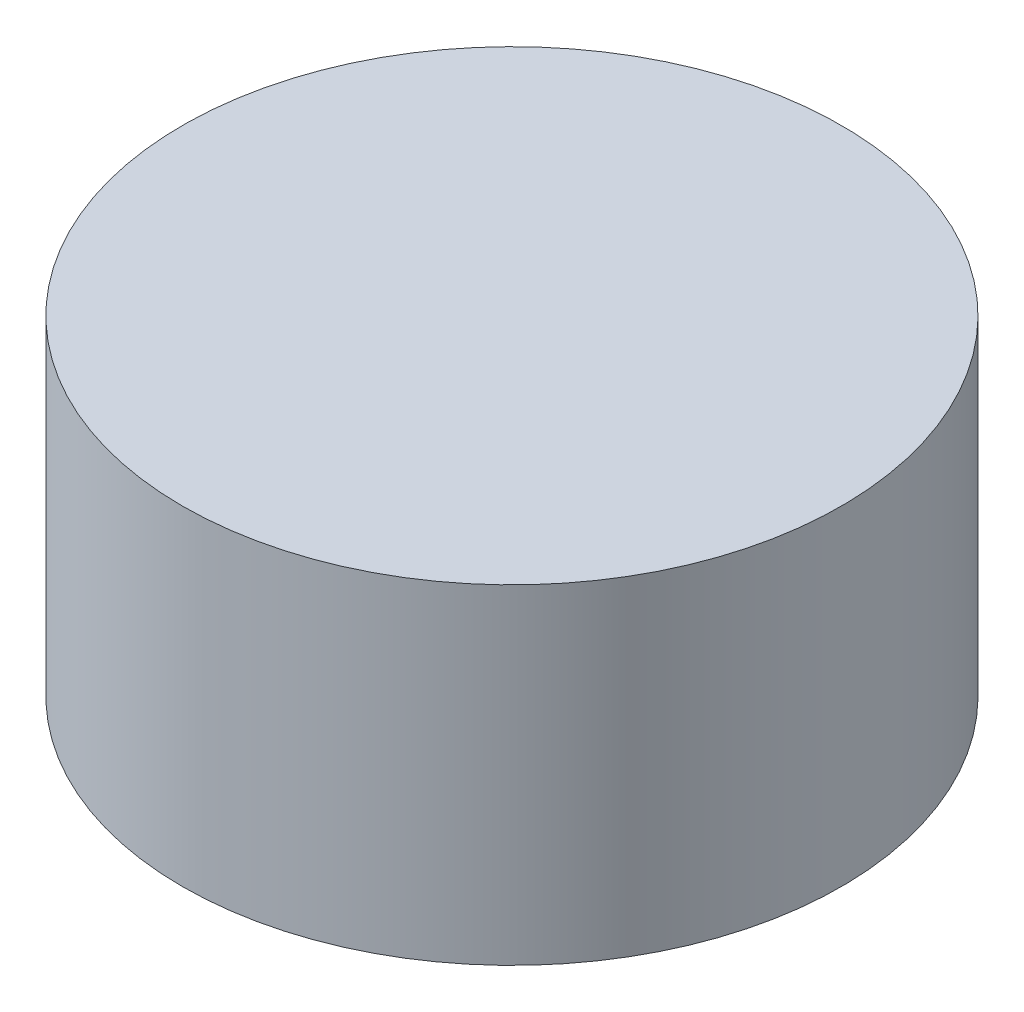
ISO-10303-21;
HEADER;
FILE_DESCRIPTION(('STEP AP214'),'2;1');
FILE_NAME('part.step','',(''),(''),'','','');
FILE_SCHEMA(('AUTOMOTIVE_DESIGN { 1 0 10303 214 1 1 1 1 }'));
ENDSEC;
DATA;
#1=APPLICATION_CONTEXT('core data for automotive mechanical design processes');
#2=APPLICATION_PROTOCOL_DEFINITION('international standard','automotive_design',2000,#1);
#3=PRODUCT_CONTEXT('',#1,'mechanical');
#4=PRODUCT('Part','Part','',(#3));
#5=PRODUCT_RELATED_PRODUCT_CATEGORY('part','',(#4));
#6=PRODUCT_DEFINITION_FORMATION('','',#4);
#7=PRODUCT_DEFINITION_CONTEXT('part definition',#1,'design');
#8=PRODUCT_DEFINITION('design','',#6,#7);
#9=PRODUCT_DEFINITION_SHAPE('','',#8);
#10=(LENGTH_UNIT() NAMED_UNIT(*) SI_UNIT(.MILLI.,.METRE.));
#11=(NAMED_UNIT(*) PLANE_ANGLE_UNIT() SI_UNIT($,.RADIAN.));
#12=(NAMED_UNIT(*) SI_UNIT($,.STERADIAN.) SOLID_ANGLE_UNIT());
#13=UNCERTAINTY_MEASURE_WITH_UNIT(LENGTH_MEASURE(1.E-05),#10,'distance_accuracy_value','');
#14=(GEOMETRIC_REPRESENTATION_CONTEXT(3) GLOBAL_UNCERTAINTY_ASSIGNED_CONTEXT((#13)) GLOBAL_UNIT_ASSIGNED_CONTEXT((#10,
#11,#12)) REPRESENTATION_CONTEXT('',''));
#15=CARTESIAN_POINT('',(0.,0.,0.));
#16=DIRECTION('',(0.,0.,1.));
#17=DIRECTION('',(1.,0.,0.));
#18=AXIS2_PLACEMENT_3D('',#15,#16,#17);
#19=CARTESIAN_POINT('',(0.,10.,0.));
#20=DIRECTION('',(0.,-1.,0.));
#21=DIRECTION('',(0.,0.,-1.));
#22=AXIS2_PLACEMENT_3D('',#19,#20,#21);
#23=CYLINDRICAL_SURFACE('',#22,10.);
#24=CARTESIAN_POINT('',(0.,10.,0.));
#25=DIRECTION('',(0.,1.,0.));
#26=DIRECTION('',(0.,0.,1.));
#27=AXIS2_PLACEMENT_3D('',#24,#25,#26);
#28=CIRCLE('',#27,10.);
#29=CARTESIAN_POINT('',(0.,10.,10.));
#30=VERTEX_POINT('',#29);
#31=EDGE_CURVE('E10',#30,#30,#28,.T.);
#32=ORIENTED_EDGE('',*,*,#31,.F.);
#33=EDGE_LOOP('',(#32));
#34=FACE_BOUND('',#33,.T.);
#35=CARTESIAN_POINT('',(0.,0.,0.));
#36=DIRECTION('',(0.,1.,0.));
#37=DIRECTION('',(0.,0.,1.));
#38=AXIS2_PLACEMENT_3D('',#35,#36,#37);
#39=CIRCLE('',#38,10.);
#40=CARTESIAN_POINT('',(0.,0.,10.));
#41=VERTEX_POINT('',#40);
#42=EDGE_CURVE('E32',#41,#41,#39,.T.);
#43=ORIENTED_EDGE('',*,*,#42,.T.);
#44=EDGE_LOOP('',(#43));
#45=FACE_BOUND('',#44,.T.);
#46=ADVANCED_FACE('F29',(#34,#45),#23,.T.);
#47=CARTESIAN_POINT('',(0.,10.,0.));
#48=DIRECTION('',(0.,1.,0.));
#49=DIRECTION('',(0.,0.,1.));
#50=AXIS2_PLACEMENT_3D('',#47,#48,#49);
#51=PLANE('',#50);
#52=ORIENTED_EDGE('',*,*,#31,.T.);
#53=EDGE_LOOP('',(#52));
#54=FACE_BOUND('',#53,.T.);
#55=ADVANCED_FACE('F44',(#54),#51,.T.);
#56=CARTESIAN_POINT('',(0.,0.,0.));
#57=DIRECTION('',(0.,1.,0.));
#58=DIRECTION('',(0.,0.,1.));
#59=AXIS2_PLACEMENT_3D('',#56,#57,#58);
#60=PLANE('',#59);
#61=ORIENTED_EDGE('',*,*,#42,.F.);
#62=EDGE_LOOP('',(#61));
#63=FACE_BOUND('',#62,.T.);
#64=ADVANCED_FACE('F42',(#63),#60,.F.);
#65=CLOSED_SHELL('',(#46,#55,#64));
#66=MANIFOLD_SOLID_BREP('B2',#65);
#67=ADVANCED_BREP_SHAPE_REPRESENTATION('',(#18,#66),#14);
#68=SHAPE_DEFINITION_REPRESENTATION(#9,#67);
ENDSEC;
END-ISO-10303-21;
